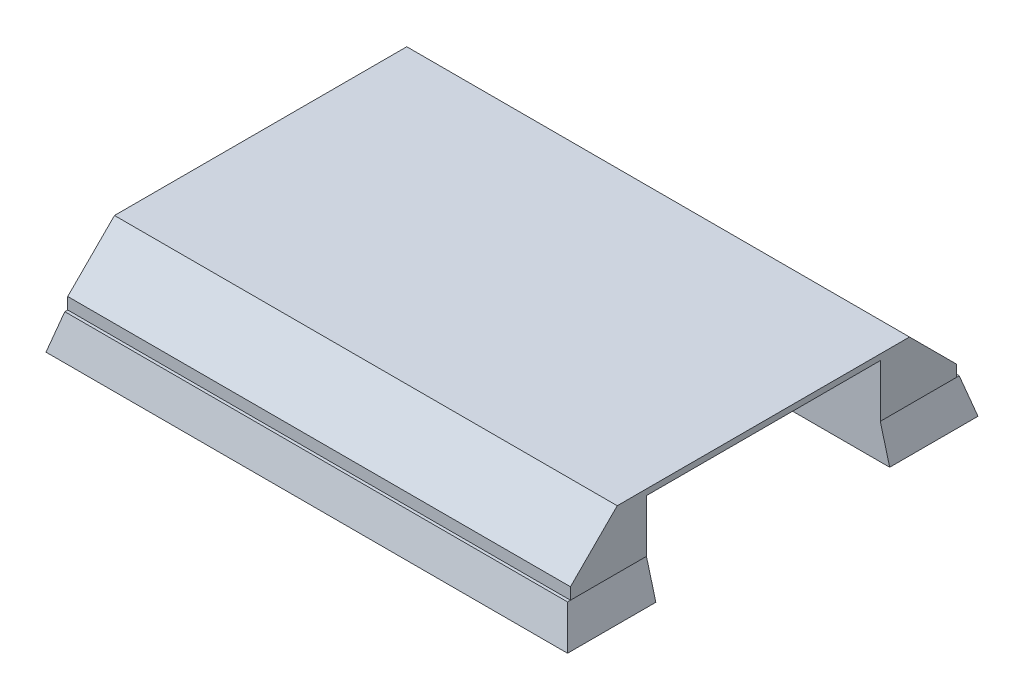
ISO-10303-21;
HEADER;
FILE_DESCRIPTION(('STEP AP214'),'2;1');
FILE_NAME('part.step','',(''),(''),'','','');
FILE_SCHEMA(('AUTOMOTIVE_DESIGN { 1 0 10303 214 1 1 1 1 }'));
ENDSEC;
DATA;
#1=APPLICATION_CONTEXT('core data for automotive mechanical design processes');
#2=APPLICATION_PROTOCOL_DEFINITION('international standard','automotive_design',2000,#1);
#3=PRODUCT_CONTEXT('',#1,'mechanical');
#4=PRODUCT('Part','Part','',(#3));
#5=PRODUCT_RELATED_PRODUCT_CATEGORY('part','',(#4));
#6=PRODUCT_DEFINITION_FORMATION('','',#4);
#7=PRODUCT_DEFINITION_CONTEXT('part definition',#1,'design');
#8=PRODUCT_DEFINITION('design','',#6,#7);
#9=PRODUCT_DEFINITION_SHAPE('','',#8);
#10=(LENGTH_UNIT() NAMED_UNIT(*) SI_UNIT(.MILLI.,.METRE.));
#11=(NAMED_UNIT(*) PLANE_ANGLE_UNIT() SI_UNIT($,.RADIAN.));
#12=(NAMED_UNIT(*) SI_UNIT($,.STERADIAN.) SOLID_ANGLE_UNIT());
#13=UNCERTAINTY_MEASURE_WITH_UNIT(LENGTH_MEASURE(1.E-05),#10,'distance_accuracy_value','');
#14=(GEOMETRIC_REPRESENTATION_CONTEXT(3) GLOBAL_UNCERTAINTY_ASSIGNED_CONTEXT((#13)) GLOBAL_UNIT_ASSIGNED_CONTEXT((#10,
#11,#12)) REPRESENTATION_CONTEXT('',''));
#15=CARTESIAN_POINT('',(0.,0.,0.));
#16=DIRECTION('',(0.,0.,1.));
#17=DIRECTION('',(1.,0.,0.));
#18=AXIS2_PLACEMENT_3D('',#15,#16,#17);
#19=CARTESIAN_POINT('',(0.,-3.,0.));
#20=DIRECTION('',(0.,1.,0.));
#21=DIRECTION('',(0.,0.,1.));
#22=AXIS2_PLACEMENT_3D('',#19,#20,#21);
#23=PLANE('',#22);
#24=DIRECTION('',(0.,0.,-1.));
#25=VECTOR('',#24,1.);
#26=CARTESIAN_POINT('',(22.3038475772934,-3.,0.));
#27=LINE('',#26,#25);
#28=CARTESIAN_POINT('',(22.3038475772934,-3.,-10.));
#29=VERTEX_POINT('',#28);
#30=CARTESIAN_POINT('',(22.3038475772934,-3.,-17.5538475772934));
#31=VERTEX_POINT('',#30);
#32=EDGE_CURVE('E210',#29,#31,#27,.T.);
#33=ORIENTED_EDGE('',*,*,#32,.F.);
#34=DIRECTION('',(-1.,0.,0.));
#35=VECTOR('',#34,1.);
#36=CARTESIAN_POINT('',(0.,-3.,-10.));
#37=LINE('',#36,#35);
#38=CARTESIAN_POINT('',(-22.3038475772934,-3.,-9.99999999999999));
#39=VERTEX_POINT('',#38);
#40=EDGE_CURVE('E191',#29,#39,#37,.T.);
#41=ORIENTED_EDGE('',*,*,#40,.T.);
#42=DIRECTION('',(0.,0.,1.));
#43=VECTOR('',#42,1.);
#44=CARTESIAN_POINT('',(-22.3038475772934,-3.,0.));
#45=LINE('',#44,#43);
#46=CARTESIAN_POINT('',(-22.3038475772934,-3.,-17.5538475772934));
#47=VERTEX_POINT('',#46);
#48=EDGE_CURVE('E230',#47,#39,#45,.T.);
#49=ORIENTED_EDGE('',*,*,#48,.F.);
#50=DIRECTION('',(-1.,0.,0.));
#51=VECTOR('',#50,1.);
#52=CARTESIAN_POINT('',(0.,-3.,-17.5538475772934));
#53=LINE('',#52,#51);
#54=EDGE_CURVE('E221',#31,#47,#53,.T.);
#55=ORIENTED_EDGE('',*,*,#54,.F.);
#56=EDGE_LOOP('',(#33,#41,#49,#55));
#57=FACE_BOUND('',#56,.T.);
#58=ADVANCED_FACE('F41',(#57),#23,.F.);
#59=CARTESIAN_POINT('',(21.5,0.,16.75));
#60=DIRECTION('',(0.965925826289068,0.258819045102521,0.));
#61=DIRECTION('',(-0.258819045102521,0.965925826289068,0.));
#62=AXIS2_PLACEMENT_3D('',#59,#60,#61);
#63=PLANE('',#62);
#64=DIRECTION('',(-0.258819045102521,0.965925826289068,0.));
#65=VECTOR('',#64,1.);
#66=CARTESIAN_POINT('',(21.5,0.,-10.));
#67=LINE('',#66,#65);
#68=CARTESIAN_POINT('',(21.5,0.,-10.));
#69=VERTEX_POINT('',#68);
#70=EDGE_CURVE('E194',#29,#69,#67,.T.);
#71=ORIENTED_EDGE('',*,*,#70,.F.);
#72=ORIENTED_EDGE('',*,*,#32,.T.);
#73=DIRECTION('',(-0.250562807085732,0.935113126531029,0.250562807085732));
#74=VECTOR('',#73,1.);
#75=CARTESIAN_POINT('',(19.3968123701282,7.84920309253205,-14.6468123701282));
#76=LINE('',#75,#74);
#77=CARTESIAN_POINT('',(21.5,0.,-16.75));
#78=VERTEX_POINT('',#77);
#79=EDGE_CURVE('E348',#31,#78,#76,.T.);
#80=ORIENTED_EDGE('',*,*,#79,.T.);
#81=DIRECTION('',(0.,0.,-1.));
#82=VECTOR('',#81,1.);
#83=CARTESIAN_POINT('',(21.5,0.,16.75));
#84=LINE('',#83,#82);
#85=CARTESIAN_POINT('',(21.5,0.,-16.5));
#86=VERTEX_POINT('',#85);
#87=EDGE_CURVE('E336',#86,#78,#84,.T.);
#88=ORIENTED_EDGE('',*,*,#87,.F.);
#89=DIRECTION('',(0.,0.,-1.));
#90=VECTOR('',#89,1.);
#91=CARTESIAN_POINT('',(21.5,0.,16.5));
#92=LINE('',#91,#90);
#93=EDGE_CURVE('E214',#69,#86,#92,.T.);
#94=ORIENTED_EDGE('',*,*,#93,.F.);
#95=EDGE_LOOP('',(#71,#72,#80,#88,#94));
#96=FACE_BOUND('',#95,.T.);
#97=ADVANCED_FACE('F208',(#96),#63,.T.);
#98=DIRECTION('',(1.,0.,0.));
#99=VECTOR('',#98,1.);
#100=CARTESIAN_POINT('',(0.,-3.,10.));
#101=LINE('',#100,#99);
#102=CARTESIAN_POINT('',(-22.3038475772934,-3.,10.));
#103=VERTEX_POINT('',#102);
#104=CARTESIAN_POINT('',(22.3038475772934,-3.,10.));
#105=VERTEX_POINT('',#104);
#106=EDGE_CURVE('E203',#103,#105,#101,.T.);
#107=ORIENTED_EDGE('',*,*,#106,.T.);
#108=CARTESIAN_POINT('',(22.3038475772934,-3.,17.5538475772934));
#109=VERTEX_POINT('',#108);
#110=EDGE_CURVE('E223',#109,#105,#27,.T.);
#111=ORIENTED_EDGE('',*,*,#110,.F.);
#112=DIRECTION('',(1.,0.,0.));
#113=VECTOR('',#112,1.);
#114=CARTESIAN_POINT('',(0.,-3.,17.5538475772934));
#115=LINE('',#114,#113);
#116=CARTESIAN_POINT('',(-22.3038475772934,-3.,17.5538475772934));
#117=VERTEX_POINT('',#116);
#118=EDGE_CURVE('E224',#117,#109,#115,.T.);
#119=ORIENTED_EDGE('',*,*,#118,.F.);
#120=EDGE_CURVE('E345',#103,#117,#45,.T.);
#121=ORIENTED_EDGE('',*,*,#120,.F.);
#122=EDGE_LOOP('',(#107,#111,#119,#121));
#123=FACE_BOUND('',#122,.T.);
#124=ADVANCED_FACE('F370',(#123),#23,.F.);
#125=CARTESIAN_POINT('',(0.,0.,0.));
#126=DIRECTION('',(0.,1.,0.));
#127=DIRECTION('',(0.,0.,1.));
#128=AXIS2_PLACEMENT_3D('',#125,#126,#127);
#129=PLANE('',#128);
#130=DIRECTION('',(1.,0.,0.));
#131=VECTOR('',#130,1.);
#132=CARTESIAN_POINT('',(-21.5,0.,16.5));
#133=LINE('',#132,#131);
#134=CARTESIAN_POINT('',(-21.5,0.,16.5));
#135=VERTEX_POINT('',#134);
#136=CARTESIAN_POINT('',(21.5,0.,16.5));
#137=VERTEX_POINT('',#136);
#138=EDGE_CURVE('E306',#135,#137,#133,.T.);
#139=ORIENTED_EDGE('',*,*,#138,.F.);
#140=DIRECTION('',(0.,0.,1.));
#141=VECTOR('',#140,1.);
#142=CARTESIAN_POINT('',(-21.5,0.,16.75));
#143=LINE('',#142,#141);
#144=CARTESIAN_POINT('',(-21.5,0.,16.75));
#145=VERTEX_POINT('',#144);
#146=EDGE_CURVE('E323',#135,#145,#143,.T.);
#147=ORIENTED_EDGE('',*,*,#146,.T.);
#148=DIRECTION('',(1.,0.,0.));
#149=VECTOR('',#148,1.);
#150=CARTESIAN_POINT('',(21.5,0.,16.75));
#151=LINE('',#150,#149);
#152=CARTESIAN_POINT('',(21.5,0.,16.75));
#153=VERTEX_POINT('',#152);
#154=EDGE_CURVE('E332',#145,#153,#151,.T.);
#155=ORIENTED_EDGE('',*,*,#154,.T.);
#156=EDGE_CURVE('E337',#153,#137,#84,.T.);
#157=ORIENTED_EDGE('',*,*,#156,.T.);
#158=EDGE_LOOP('',(#139,#147,#155,#157));
#159=FACE_BOUND('',#158,.T.);
#160=ADVANCED_FACE('F382',(#159),#129,.T.);
#161=CARTESIAN_POINT('',(-21.5,0.,16.75));
#162=DIRECTION('',(-0.965925826289068,0.258819045102521,0.));
#163=DIRECTION('',(-0.258819045102521,-0.965925826289068,0.));
#164=AXIS2_PLACEMENT_3D('',#161,#162,#163);
#165=PLANE('',#164);
#166=ORIENTED_EDGE('',*,*,#48,.T.);
#167=DIRECTION('',(0.258819045102521,0.965925826289068,0.));
#168=VECTOR('',#167,1.);
#169=CARTESIAN_POINT('',(-20.3570508075689,4.26554445662277,-10.));
#170=LINE('',#169,#168);
#171=CARTESIAN_POINT('',(-21.8660254037844,-1.36602540378436,-10.));
#172=VERTEX_POINT('',#171);
#173=EDGE_CURVE('E197',#39,#172,#170,.T.);
#174=ORIENTED_EDGE('',*,*,#173,.T.);
#175=DIRECTION('',(0.,0.,1.));
#176=VECTOR('',#175,1.);
#177=CARTESIAN_POINT('',(-21.8660254037844,-1.36602540378436,16.75));
#178=LINE('',#177,#176);
#179=CARTESIAN_POINT('',(-21.8660254037844,-1.36602540378436,10.));
#180=VERTEX_POINT('',#179);
#181=EDGE_CURVE('E258',#172,#180,#178,.T.);
#182=ORIENTED_EDGE('',*,*,#181,.T.);
#183=DIRECTION('',(-0.258819045102521,-0.965925826289068,0.));
#184=VECTOR('',#183,1.);
#185=CARTESIAN_POINT('',(-20.3570508075689,4.26554445662277,10.));
#186=LINE('',#185,#184);
#187=EDGE_CURVE('E262',#180,#103,#186,.T.);
#188=ORIENTED_EDGE('',*,*,#187,.T.);
#189=ORIENTED_EDGE('',*,*,#120,.T.);
#190=DIRECTION('',(0.250562807085732,0.935113126531029,-0.250562807085732));
#191=VECTOR('',#190,1.);
#192=CARTESIAN_POINT('',(-21.5,0.,16.75));
#193=LINE('',#192,#191);
#194=EDGE_CURVE('E349',#117,#145,#193,.T.);
#195=ORIENTED_EDGE('',*,*,#194,.T.);
#196=ORIENTED_EDGE('',*,*,#146,.F.);
#197=DIRECTION('',(0.,0.,1.));
#198=VECTOR('',#197,1.);
#199=CARTESIAN_POINT('',(-21.5,0.,16.5));
#200=LINE('',#199,#198);
#201=CARTESIAN_POINT('',(-21.5,0.,-16.5));
#202=VERTEX_POINT('',#201);
#203=EDGE_CURVE('E392',#202,#135,#200,.T.);
#204=ORIENTED_EDGE('',*,*,#203,.F.);
#205=CARTESIAN_POINT('',(-21.5,0.,-16.75));
#206=VERTEX_POINT('',#205);
#207=EDGE_CURVE('E329',#206,#202,#143,.T.);
#208=ORIENTED_EDGE('',*,*,#207,.F.);
#209=DIRECTION('',(0.250562807085732,0.935113126531029,0.250562807085732));
#210=VECTOR('',#209,1.);
#211=CARTESIAN_POINT('',(-18.8003860273287,10.0750965068322,-14.0503860273287));
#212=LINE('',#211,#210);
#213=EDGE_CURVE('E239',#47,#206,#212,.T.);
#214=ORIENTED_EDGE('',*,*,#213,.F.);
#215=EDGE_LOOP('',(#166,#174,#182,#188,#189,#195,#196,#204,#208,#214));
#216=FACE_BOUND('',#215,.T.);
#217=ADVANCED_FACE('F362',(#216),#165,.T.);
#218=CARTESIAN_POINT('',(21.5,0.,-16.75));
#219=DIRECTION('',(0.,0.258819045102521,-0.965925826289068));
#220=DIRECTION('',(0.,0.965925826289068,0.258819045102521));
#221=AXIS2_PLACEMENT_3D('',#218,#219,#220);
#222=PLANE('',#221);
#223=DIRECTION('',(-1.,0.,0.));
#224=VECTOR('',#223,1.);
#225=CARTESIAN_POINT('',(21.5,0.,-16.75));
#226=LINE('',#225,#224);
#227=EDGE_CURVE('E341',#78,#206,#226,.T.);
#228=ORIENTED_EDGE('',*,*,#227,.F.);
#229=ORIENTED_EDGE('',*,*,#79,.F.);
#230=ORIENTED_EDGE('',*,*,#54,.T.);
#231=ORIENTED_EDGE('',*,*,#213,.T.);
#232=EDGE_LOOP('',(#228,#229,#230,#231));
#233=FACE_BOUND('',#232,.T.);
#234=ADVANCED_FACE('F390',(#233),#222,.T.);
#235=DIRECTION('',(0.258819045102521,-0.965925826289068,0.));
#236=VECTOR('',#235,1.);
#237=CARTESIAN_POINT('',(21.5,0.,10.));
#238=LINE('',#237,#236);
#239=CARTESIAN_POINT('',(21.5,0.,10.));
#240=VERTEX_POINT('',#239);
#241=EDGE_CURVE('E217',#240,#105,#238,.T.);
#242=ORIENTED_EDGE('',*,*,#241,.F.);
#243=EDGE_CURVE('E378',#137,#240,#92,.T.);
#244=ORIENTED_EDGE('',*,*,#243,.F.);
#245=ORIENTED_EDGE('',*,*,#156,.F.);
#246=DIRECTION('',(-0.250562807085732,0.935113126531029,-0.250562807085732));
#247=VECTOR('',#246,1.);
#248=CARTESIAN_POINT('',(21.5,0.,16.75));
#249=LINE('',#248,#247);
#250=EDGE_CURVE('E353',#109,#153,#249,.T.);
#251=ORIENTED_EDGE('',*,*,#250,.F.);
#252=ORIENTED_EDGE('',*,*,#110,.T.);
#253=EDGE_LOOP('',(#242,#244,#245,#251,#252));
#254=FACE_BOUND('',#253,.T.);
#255=ADVANCED_FACE('F373',(#254),#63,.T.);
#256=CARTESIAN_POINT('',(21.5,0.,16.75));
#257=DIRECTION('',(0.,0.258819045102521,0.965925826289068));
#258=DIRECTION('',(0.,-0.965925826289068,0.258819045102521));
#259=AXIS2_PLACEMENT_3D('',#256,#257,#258);
#260=PLANE('',#259);
#261=ORIENTED_EDGE('',*,*,#154,.F.);
#262=ORIENTED_EDGE('',*,*,#194,.F.);
#263=ORIENTED_EDGE('',*,*,#118,.T.);
#264=ORIENTED_EDGE('',*,*,#250,.T.);
#265=EDGE_LOOP('',(#261,#262,#263,#264));
#266=FACE_BOUND('',#265,.T.);
#267=ADVANCED_FACE('F368',(#266),#260,.T.);
#268=DIRECTION('',(-1.,0.,0.));
#269=VECTOR('',#268,1.);
#270=CARTESIAN_POINT('',(-21.5,0.,-16.5));
#271=LINE('',#270,#269);
#272=EDGE_CURVE('E317',#86,#202,#271,.T.);
#273=ORIENTED_EDGE('',*,*,#272,.F.);
#274=ORIENTED_EDGE('',*,*,#87,.T.);
#275=ORIENTED_EDGE('',*,*,#227,.T.);
#276=ORIENTED_EDGE('',*,*,#207,.T.);
#277=EDGE_LOOP('',(#273,#274,#275,#276));
#278=FACE_BOUND('',#277,.T.);
#279=ADVANCED_FACE('F387',(#278),#129,.T.);
#280=CARTESIAN_POINT('',(21.5,5.,16.5));
#281=DIRECTION('',(-1.,0.,0.));
#282=DIRECTION('',(0.,0.,1.));
#283=AXIS2_PLACEMENT_3D('',#280,#281,#282);
#284=PLANE('',#283);
#285=DIRECTION('',(0.,-1.,0.));
#286=VECTOR('',#285,1.);
#287=CARTESIAN_POINT('',(21.5,5.,-16.5));
#288=LINE('',#287,#286);
#289=CARTESIAN_POINT('',(21.5,0.99999999999999,-16.5));
#290=VERTEX_POINT('',#289);
#291=EDGE_CURVE('E296',#290,#86,#288,.T.);
#292=ORIENTED_EDGE('',*,*,#291,.F.);
#293=DIRECTION('',(0.,-0.707106781186549,-0.707106781186546));
#294=VECTOR('',#293,1.);
#295=CARTESIAN_POINT('',(21.5,5.,-12.5));
#296=LINE('',#295,#294);
#297=CARTESIAN_POINT('',(21.5,5.,-12.5));
#298=VERTEX_POINT('',#297);
#299=EDGE_CURVE('E51',#290,#298,#296,.F.);
#300=ORIENTED_EDGE('',*,*,#299,.T.);
#301=DIRECTION('',(0.,0.,-1.));
#302=VECTOR('',#301,1.);
#303=CARTESIAN_POINT('',(21.5,5.,16.5));
#304=LINE('',#303,#302);
#305=CARTESIAN_POINT('',(21.5,5.,12.5));
#306=VERTEX_POINT('',#305);
#307=EDGE_CURVE('E295',#306,#298,#304,.T.);
#308=ORIENTED_EDGE('',*,*,#307,.F.);
#309=DIRECTION('',(0.,0.707106781186549,-0.707106781186546));
#310=VECTOR('',#309,1.);
#311=CARTESIAN_POINT('',(21.5,5.,12.5));
#312=LINE('',#311,#310);
#313=CARTESIAN_POINT('',(21.5,0.999999999999976,16.5));
#314=VERTEX_POINT('',#313);
#315=EDGE_CURVE('E58',#306,#314,#312,.F.);
#316=ORIENTED_EDGE('',*,*,#315,.T.);
#317=DIRECTION('',(0.,-1.,0.));
#318=VECTOR('',#317,1.);
#319=CARTESIAN_POINT('',(21.5,5.,16.5));
#320=LINE('',#319,#318);
#321=EDGE_CURVE('E325',#314,#137,#320,.T.);
#322=ORIENTED_EDGE('',*,*,#321,.T.);
#323=ORIENTED_EDGE('',*,*,#243,.T.);
#324=DIRECTION('',(0.,-1.,0.));
#325=VECTOR('',#324,1.);
#326=CARTESIAN_POINT('',(21.5,3.5,10.));
#327=LINE('',#326,#325);
#328=CARTESIAN_POINT('',(21.5,4.5,10.));
#329=VERTEX_POINT('',#328);
#330=EDGE_CURVE('E417',#329,#240,#327,.T.);
#331=ORIENTED_EDGE('',*,*,#330,.F.);
#332=DIRECTION('',(0.,0.,-1.));
#333=VECTOR('',#332,1.);
#334=CARTESIAN_POINT('',(21.5,4.5,16.5));
#335=LINE('',#334,#333);
#336=CARTESIAN_POINT('',(21.5,4.5,-10.));
#337=VERTEX_POINT('',#336);
#338=EDGE_CURVE('E243',#329,#337,#335,.T.);
#339=ORIENTED_EDGE('',*,*,#338,.T.);
#340=DIRECTION('',(0.,-1.,0.));
#341=VECTOR('',#340,1.);
#342=CARTESIAN_POINT('',(21.5,5.,-10.));
#343=LINE('',#342,#341);
#344=EDGE_CURVE('E235',#337,#69,#343,.T.);
#345=ORIENTED_EDGE('',*,*,#344,.T.);
#346=ORIENTED_EDGE('',*,*,#93,.T.);
#347=EDGE_LOOP('',(#292,#300,#308,#316,#322,#323,#331,#339,#345,#346));
#348=FACE_BOUND('',#347,.T.);
#349=ADVANCED_FACE('F294',(#348),#284,.F.);
#350=CARTESIAN_POINT('',(-21.5,5.,-16.5));
#351=DIRECTION('',(0.,0.,1.));
#352=DIRECTION('',(1.,0.,0.));
#353=AXIS2_PLACEMENT_3D('',#350,#351,#352);
#354=PLANE('',#353);
#355=DIRECTION('',(0.,-1.,0.));
#356=VECTOR('',#355,1.);
#357=CARTESIAN_POINT('',(-21.5,5.,-16.5));
#358=LINE('',#357,#356);
#359=CARTESIAN_POINT('',(-21.5,0.99999999999999,-16.5));
#360=VERTEX_POINT('',#359);
#361=EDGE_CURVE('E312',#360,#202,#358,.T.);
#362=ORIENTED_EDGE('',*,*,#361,.F.);
#363=DIRECTION('',(1.,0.,0.));
#364=VECTOR('',#363,1.);
#365=CARTESIAN_POINT('',(-21.5,0.99999999999999,-16.5));
#366=LINE('',#365,#364);
#367=EDGE_CURVE('E66',#360,#290,#366,.T.);
#368=ORIENTED_EDGE('',*,*,#367,.T.);
#369=ORIENTED_EDGE('',*,*,#291,.T.);
#370=ORIENTED_EDGE('',*,*,#272,.T.);
#371=EDGE_LOOP('',(#362,#368,#369,#370));
#372=FACE_BOUND('',#371,.T.);
#373=ADVANCED_FACE('F315',(#372),#354,.F.);
#374=CARTESIAN_POINT('',(-21.5,5.,16.5));
#375=DIRECTION('',(1.,0.,0.));
#376=DIRECTION('',(0.,0.,-1.));
#377=AXIS2_PLACEMENT_3D('',#374,#375,#376);
#378=PLANE('',#377);
#379=DIRECTION('',(0.,0.,1.));
#380=VECTOR('',#379,1.);
#381=CARTESIAN_POINT('',(-21.5,5.,16.5));
#382=LINE('',#381,#380);
#383=CARTESIAN_POINT('',(-21.5,5.,-12.5));
#384=VERTEX_POINT('',#383);
#385=CARTESIAN_POINT('',(-21.5,5.,12.5));
#386=VERTEX_POINT('',#385);
#387=EDGE_CURVE('E305',#384,#386,#382,.T.);
#388=ORIENTED_EDGE('',*,*,#387,.F.);
#389=DIRECTION('',(0.,0.707106781186549,0.707106781186546));
#390=VECTOR('',#389,1.);
#391=CARTESIAN_POINT('',(-21.5,5.,-12.5));
#392=LINE('',#391,#390);
#393=EDGE_CURVE('E285',#384,#360,#392,.F.);
#394=ORIENTED_EDGE('',*,*,#393,.T.);
#395=ORIENTED_EDGE('',*,*,#361,.T.);
#396=ORIENTED_EDGE('',*,*,#203,.T.);
#397=DIRECTION('',(0.,-1.,0.));
#398=VECTOR('',#397,1.);
#399=CARTESIAN_POINT('',(-21.5,5.,16.5));
#400=LINE('',#399,#398);
#401=CARTESIAN_POINT('',(-21.5,0.999999999999976,16.5));
#402=VERTEX_POINT('',#401);
#403=EDGE_CURVE('E319',#402,#135,#400,.T.);
#404=ORIENTED_EDGE('',*,*,#403,.F.);
#405=DIRECTION('',(0.,-0.707106781186549,0.707106781186546));
#406=VECTOR('',#405,1.);
#407=CARTESIAN_POINT('',(-21.5,5.,12.5));
#408=LINE('',#407,#406);
#409=EDGE_CURVE('E282',#402,#386,#408,.F.);
#410=ORIENTED_EDGE('',*,*,#409,.T.);
#411=EDGE_LOOP('',(#388,#394,#395,#396,#404,#410));
#412=FACE_BOUND('',#411,.T.);
#413=ADVANCED_FACE('F310',(#412),#378,.F.);
#414=CARTESIAN_POINT('',(-21.5,5.,16.5));
#415=DIRECTION('',(0.,0.,-1.));
#416=DIRECTION('',(-1.,0.,0.));
#417=AXIS2_PLACEMENT_3D('',#414,#415,#416);
#418=PLANE('',#417);
#419=ORIENTED_EDGE('',*,*,#321,.F.);
#420=DIRECTION('',(-1.,0.,0.));
#421=VECTOR('',#420,1.);
#422=CARTESIAN_POINT('',(-21.5,0.999999999999976,16.5));
#423=LINE('',#422,#421);
#424=EDGE_CURVE('E11',#314,#402,#423,.T.);
#425=ORIENTED_EDGE('',*,*,#424,.T.);
#426=ORIENTED_EDGE('',*,*,#403,.T.);
#427=ORIENTED_EDGE('',*,*,#138,.T.);
#428=EDGE_LOOP('',(#419,#425,#426,#427));
#429=FACE_BOUND('',#428,.T.);
#430=ADVANCED_FACE('F665',(#429),#418,.F.);
#431=CARTESIAN_POINT('',(0.,5.,0.));
#432=DIRECTION('',(0.,-1.,0.));
#433=DIRECTION('',(0.,0.,-1.));
#434=AXIS2_PLACEMENT_3D('',#431,#432,#433);
#435=PLANE('',#434);
#436=ORIENTED_EDGE('',*,*,#307,.T.);
#437=DIRECTION('',(-1.,0.,0.));
#438=VECTOR('',#437,1.);
#439=CARTESIAN_POINT('',(0.,5.,-12.5));
#440=LINE('',#439,#438);
#441=EDGE_CURVE('E278',#298,#384,#440,.T.);
#442=ORIENTED_EDGE('',*,*,#441,.T.);
#443=ORIENTED_EDGE('',*,*,#387,.T.);
#444=DIRECTION('',(1.,0.,0.));
#445=VECTOR('',#444,1.);
#446=CARTESIAN_POINT('',(0.,5.,12.5));
#447=LINE('',#446,#445);
#448=EDGE_CURVE('E274',#386,#306,#447,.T.);
#449=ORIENTED_EDGE('',*,*,#448,.T.);
#450=EDGE_LOOP('',(#436,#442,#443,#449));
#451=FACE_BOUND('',#450,.T.);
#452=ADVANCED_FACE('F300',(#451),#435,.F.);
#453=CARTESIAN_POINT('',(-17.5,0.,0.));
#454=DIRECTION('',(1.,0.,0.));
#455=DIRECTION('',(0.,0.,-1.));
#456=AXIS2_PLACEMENT_3D('',#453,#454,#455);
#457=PLANE('',#456);
#458=DIRECTION('',(0.,-1.,0.));
#459=VECTOR('',#458,1.);
#460=CARTESIAN_POINT('',(-17.5,3.5,10.));
#461=LINE('',#460,#459);
#462=CARTESIAN_POINT('',(-17.5,3.5,10.));
#463=VERTEX_POINT('',#462);
#464=CARTESIAN_POINT('',(-17.5,3.0000000000001,10.));
#465=VERTEX_POINT('',#464);
#466=EDGE_CURVE('E420',#463,#465,#461,.T.);
#467=ORIENTED_EDGE('',*,*,#466,.T.);
#468=DIRECTION('',(0.,0.,-1.));
#469=VECTOR('',#468,1.);
#470=CARTESIAN_POINT('',(-17.5,3.0000000000001,-10.));
#471=LINE('',#470,#469);
#472=CARTESIAN_POINT('',(-17.5,3.0000000000001,-10.));
#473=VERTEX_POINT('',#472);
#474=EDGE_CURVE('E254',#465,#473,#471,.T.);
#475=ORIENTED_EDGE('',*,*,#474,.T.);
#476=DIRECTION('',(0.,1.,0.));
#477=VECTOR('',#476,1.);
#478=CARTESIAN_POINT('',(-17.5,3.5,-10.));
#479=LINE('',#478,#477);
#480=CARTESIAN_POINT('',(-17.5,3.5,-10.));
#481=VERTEX_POINT('',#480);
#482=EDGE_CURVE('E425',#473,#481,#479,.T.);
#483=ORIENTED_EDGE('',*,*,#482,.T.);
#484=DIRECTION('',(0.,0.,1.));
#485=VECTOR('',#484,1.);
#486=CARTESIAN_POINT('',(-17.5,3.5,10.));
#487=LINE('',#486,#485);
#488=EDGE_CURVE('E413',#481,#463,#487,.T.);
#489=ORIENTED_EDGE('',*,*,#488,.T.);
#490=EDGE_LOOP('',(#467,#475,#483,#489));
#491=FACE_BOUND('',#490,.T.);
#492=ADVANCED_FACE('F488',(#491),#457,.T.);
#493=CARTESIAN_POINT('',(-17.5,3.5,10.));
#494=DIRECTION('',(0.,0.,1.));
#495=DIRECTION('',(0.,-1.,0.));
#496=AXIS2_PLACEMENT_3D('',#493,#494,#495);
#497=PLANE('',#496);
#498=ORIENTED_EDGE('',*,*,#466,.F.);
#499=DIRECTION('',(1.,0.,0.));
#500=VECTOR('',#499,1.);
#501=CARTESIAN_POINT('',(-17.5,3.5,10.));
#502=LINE('',#501,#500);
#503=CARTESIAN_POINT('',(20.5,3.5,10.));
#504=VERTEX_POINT('',#503);
#505=EDGE_CURVE('E204',#463,#504,#502,.T.);
#506=ORIENTED_EDGE('',*,*,#505,.T.);
#507=DIRECTION('',(-0.707106781186548,-0.707106781186547,0.));
#508=VECTOR('',#507,1.);
#509=CARTESIAN_POINT('',(1.49999999999999,-15.5,10.));
#510=LINE('',#509,#508);
#511=EDGE_CURVE('E247',#504,#329,#510,.F.);
#512=ORIENTED_EDGE('',*,*,#511,.T.);
#513=ORIENTED_EDGE('',*,*,#330,.T.);
#514=ORIENTED_EDGE('',*,*,#241,.T.);
#515=ORIENTED_EDGE('',*,*,#106,.F.);
#516=ORIENTED_EDGE('',*,*,#187,.F.);
#517=DIRECTION('',(0.707106781186544,0.707106781186551,0.));
#518=VECTOR('',#517,1.);
#519=CARTESIAN_POINT('',(-17.25,3.25000000000006,10.));
#520=LINE('',#519,#518);
#521=EDGE_CURVE('E271',#180,#465,#520,.T.);
#522=ORIENTED_EDGE('',*,*,#521,.T.);
#523=EDGE_LOOP('',(#498,#506,#512,#513,#514,#515,#516,#522));
#524=FACE_BOUND('',#523,.T.);
#525=ADVANCED_FACE('F476',(#524),#497,.F.);
#526=CARTESIAN_POINT('',(-17.5,3.5,-10.));
#527=DIRECTION('',(0.,0.,-1.));
#528=DIRECTION('',(-1.,0.,0.));
#529=AXIS2_PLACEMENT_3D('',#526,#527,#528);
#530=PLANE('',#529);
#531=ORIENTED_EDGE('',*,*,#40,.F.);
#532=ORIENTED_EDGE('',*,*,#70,.T.);
#533=ORIENTED_EDGE('',*,*,#344,.F.);
#534=DIRECTION('',(0.707106781186548,0.707106781186547,0.));
#535=VECTOR('',#534,1.);
#536=CARTESIAN_POINT('',(1.49999999999999,-15.5,-10.));
#537=LINE('',#536,#535);
#538=CARTESIAN_POINT('',(20.5,3.5,-10.));
#539=VERTEX_POINT('',#538);
#540=EDGE_CURVE('E251',#337,#539,#537,.F.);
#541=ORIENTED_EDGE('',*,*,#540,.T.);
#542=DIRECTION('',(1.,0.,0.));
#543=VECTOR('',#542,1.);
#544=CARTESIAN_POINT('',(-17.5,3.5,-10.));
#545=LINE('',#544,#543);
#546=EDGE_CURVE('E409',#481,#539,#545,.T.);
#547=ORIENTED_EDGE('',*,*,#546,.F.);
#548=ORIENTED_EDGE('',*,*,#482,.F.);
#549=DIRECTION('',(-0.707106781186544,-0.707106781186551,0.));
#550=VECTOR('',#549,1.);
#551=CARTESIAN_POINT('',(-17.25,3.25000000000006,-10.));
#552=LINE('',#551,#550);
#553=EDGE_CURVE('E268',#473,#172,#552,.T.);
#554=ORIENTED_EDGE('',*,*,#553,.T.);
#555=ORIENTED_EDGE('',*,*,#173,.F.);
#556=EDGE_LOOP('',(#531,#532,#533,#541,#547,#548,#554,#555));
#557=FACE_BOUND('',#556,.T.);
#558=ADVANCED_FACE('F193',(#557),#530,.F.);
#559=CARTESIAN_POINT('',(-17.5,3.5,10.));
#560=DIRECTION('',(0.,1.,0.));
#561=DIRECTION('',(0.,0.,1.));
#562=AXIS2_PLACEMENT_3D('',#559,#560,#561);
#563=PLANE('',#562);
#564=DIRECTION('',(-1.,0.,0.));
#565=VECTOR('',#564,1.);
#566=CARTESIAN_POINT('',(18.5,3.5,9.));
#567=LINE('',#566,#565);
#568=CARTESIAN_POINT('',(18.5,3.5,9.));
#569=VERTEX_POINT('',#568);
#570=CARTESIAN_POINT('',(10.5,3.5,9.));
#571=VERTEX_POINT('',#570);
#572=EDGE_CURVE('E453',#569,#571,#567,.T.);
#573=ORIENTED_EDGE('',*,*,#572,.F.);
#574=DIRECTION('',(0.,0.,1.));
#575=VECTOR('',#574,1.);
#576=CARTESIAN_POINT('',(18.5,3.5,9.));
#577=LINE('',#576,#575);
#578=CARTESIAN_POINT('',(18.5,3.5,-9.));
#579=VERTEX_POINT('',#578);
#580=EDGE_CURVE('E216',#579,#569,#577,.T.);
#581=ORIENTED_EDGE('',*,*,#580,.F.);
#582=DIRECTION('',(1.,0.,0.));
#583=VECTOR('',#582,1.);
#584=CARTESIAN_POINT('',(18.5,3.5,-9.));
#585=LINE('',#584,#583);
#586=CARTESIAN_POINT('',(10.5,3.5,-9.));
#587=VERTEX_POINT('',#586);
#588=EDGE_CURVE('E444',#587,#579,#585,.T.);
#589=ORIENTED_EDGE('',*,*,#588,.F.);
#590=DIRECTION('',(0.,0.,-1.));
#591=VECTOR('',#590,1.);
#592=CARTESIAN_POINT('',(10.5,3.5,9.));
#593=LINE('',#592,#591);
#594=EDGE_CURVE('E449',#571,#587,#593,.T.);
#595=ORIENTED_EDGE('',*,*,#594,.F.);
#596=EDGE_LOOP('',(#573,#581,#589,#595));
#597=FACE_BOUND('',#596,.T.);
#598=ORIENTED_EDGE('',*,*,#546,.T.);
#599=DIRECTION('',(0.,0.,1.));
#600=VECTOR('',#599,1.);
#601=CARTESIAN_POINT('',(20.5,3.5,10.));
#602=LINE('',#601,#600);
#603=EDGE_CURVE('E238',#539,#504,#602,.T.);
#604=ORIENTED_EDGE('',*,*,#603,.T.);
#605=ORIENTED_EDGE('',*,*,#505,.F.);
#606=ORIENTED_EDGE('',*,*,#488,.F.);
#607=EDGE_LOOP('',(#598,#604,#605,#606));
#608=FACE_BOUND('',#607,.T.);
#609=ADVANCED_FACE('F486',(#597,#608),#563,.F.);
#610=CARTESIAN_POINT('',(18.5,4.5,9.));
#611=DIRECTION('',(1.,0.,0.));
#612=DIRECTION('',(0.,0.,-1.));
#613=AXIS2_PLACEMENT_3D('',#610,#611,#612);
#614=PLANE('',#613);
#615=ORIENTED_EDGE('',*,*,#580,.T.);
#616=DIRECTION('',(0.,-1.,0.));
#617=VECTOR('',#616,1.);
#618=CARTESIAN_POINT('',(18.5,4.5,9.));
#619=LINE('',#618,#617);
#620=CARTESIAN_POINT('',(18.5,4.5,9.));
#621=VERTEX_POINT('',#620);
#622=EDGE_CURVE('E431',#621,#569,#619,.T.);
#623=ORIENTED_EDGE('',*,*,#622,.F.);
#624=DIRECTION('',(0.,0.,1.));
#625=VECTOR('',#624,1.);
#626=CARTESIAN_POINT('',(18.5,4.5,9.));
#627=LINE('',#626,#625);
#628=CARTESIAN_POINT('',(18.5,4.5,-9.));
#629=VERTEX_POINT('',#628);
#630=EDGE_CURVE('E448',#629,#621,#627,.T.);
#631=ORIENTED_EDGE('',*,*,#630,.F.);
#632=DIRECTION('',(0.,-1.,0.));
#633=VECTOR('',#632,1.);
#634=CARTESIAN_POINT('',(18.5,4.5,-9.));
#635=LINE('',#634,#633);
#636=EDGE_CURVE('E421',#629,#579,#635,.T.);
#637=ORIENTED_EDGE('',*,*,#636,.T.);
#638=EDGE_LOOP('',(#615,#623,#631,#637));
#639=FACE_BOUND('',#638,.T.);
#640=ADVANCED_FACE('F589',(#639),#614,.F.);
#641=CARTESIAN_POINT('',(18.5,4.5,-9.));
#642=DIRECTION('',(0.,0.,-1.));
#643=DIRECTION('',(-1.,0.,0.));
#644=AXIS2_PLACEMENT_3D('',#641,#642,#643);
#645=PLANE('',#644);
#646=ORIENTED_EDGE('',*,*,#588,.T.);
#647=ORIENTED_EDGE('',*,*,#636,.F.);
#648=DIRECTION('',(1.,0.,0.));
#649=VECTOR('',#648,1.);
#650=CARTESIAN_POINT('',(18.5,4.5,-9.));
#651=LINE('',#650,#649);
#652=CARTESIAN_POINT('',(10.5,4.5,-9.));
#653=VERTEX_POINT('',#652);
#654=EDGE_CURVE('E436',#653,#629,#651,.T.);
#655=ORIENTED_EDGE('',*,*,#654,.F.);
#656=DIRECTION('',(0.,-1.,0.));
#657=VECTOR('',#656,1.);
#658=CARTESIAN_POINT('',(10.5,4.5,-9.));
#659=LINE('',#658,#657);
#660=EDGE_CURVE('E439',#653,#587,#659,.T.);
#661=ORIENTED_EDGE('',*,*,#660,.T.);
#662=EDGE_LOOP('',(#646,#647,#655,#661));
#663=FACE_BOUND('',#662,.T.);
#664=ADVANCED_FACE('F599',(#663),#645,.F.);
#665=CARTESIAN_POINT('',(10.5,4.5,9.));
#666=DIRECTION('',(-1.,0.,0.));
#667=DIRECTION('',(0.,0.,1.));
#668=AXIS2_PLACEMENT_3D('',#665,#666,#667);
#669=PLANE('',#668);
#670=ORIENTED_EDGE('',*,*,#594,.T.);
#671=ORIENTED_EDGE('',*,*,#660,.F.);
#672=DIRECTION('',(0.,0.,-1.));
#673=VECTOR('',#672,1.);
#674=CARTESIAN_POINT('',(10.5,4.5,9.));
#675=LINE('',#674,#673);
#676=CARTESIAN_POINT('',(10.5,4.5,9.));
#677=VERTEX_POINT('',#676);
#678=EDGE_CURVE('E462',#677,#653,#675,.T.);
#679=ORIENTED_EDGE('',*,*,#678,.F.);
#680=DIRECTION('',(0.,-1.,0.));
#681=VECTOR('',#680,1.);
#682=CARTESIAN_POINT('',(10.5,4.5,9.));
#683=LINE('',#682,#681);
#684=EDGE_CURVE('E435',#677,#571,#683,.T.);
#685=ORIENTED_EDGE('',*,*,#684,.T.);
#686=EDGE_LOOP('',(#670,#671,#679,#685));
#687=FACE_BOUND('',#686,.T.);
#688=ADVANCED_FACE('F607',(#687),#669,.F.);
#689=CARTESIAN_POINT('',(18.5,4.5,9.));
#690=DIRECTION('',(0.,0.,1.));
#691=DIRECTION('',(1.,0.,0.));
#692=AXIS2_PLACEMENT_3D('',#689,#690,#691);
#693=PLANE('',#692);
#694=ORIENTED_EDGE('',*,*,#572,.T.);
#695=ORIENTED_EDGE('',*,*,#684,.F.);
#696=DIRECTION('',(-1.,0.,0.));
#697=VECTOR('',#696,1.);
#698=CARTESIAN_POINT('',(18.5,4.5,9.));
#699=LINE('',#698,#697);
#700=EDGE_CURVE('E466',#621,#677,#699,.T.);
#701=ORIENTED_EDGE('',*,*,#700,.F.);
#702=ORIENTED_EDGE('',*,*,#622,.T.);
#703=EDGE_LOOP('',(#694,#695,#701,#702));
#704=FACE_BOUND('',#703,.T.);
#705=ADVANCED_FACE('F615',(#704),#693,.F.);
#706=CARTESIAN_POINT('',(0.,4.5,0.));
#707=DIRECTION('',(0.,1.,0.));
#708=DIRECTION('',(0.,0.,1.));
#709=AXIS2_PLACEMENT_3D('',#706,#707,#708);
#710=PLANE('',#709);
#711=ORIENTED_EDGE('',*,*,#630,.T.);
#712=ORIENTED_EDGE('',*,*,#700,.T.);
#713=ORIENTED_EDGE('',*,*,#678,.T.);
#714=ORIENTED_EDGE('',*,*,#654,.T.);
#715=EDGE_LOOP('',(#711,#712,#713,#714));
#716=FACE_BOUND('',#715,.T.);
#717=ADVANCED_FACE('F500',(#716),#710,.F.);
#718=CARTESIAN_POINT('',(20.5,3.5,10.));
#719=DIRECTION('',(-0.707106781186547,0.707106781186548,0.));
#720=DIRECTION('',(0.,0.,1.));
#721=AXIS2_PLACEMENT_3D('',#718,#719,#720);
#722=PLANE('',#721);
#723=ORIENTED_EDGE('',*,*,#540,.F.);
#724=ORIENTED_EDGE('',*,*,#338,.F.);
#725=ORIENTED_EDGE('',*,*,#511,.F.);
#726=ORIENTED_EDGE('',*,*,#603,.F.);
#727=EDGE_LOOP('',(#723,#724,#725,#726));
#728=FACE_BOUND('',#727,.T.);
#729=ADVANCED_FACE('F481',(#728),#722,.F.);
#730=CARTESIAN_POINT('',(-17.5,3.0000000000001,0.));
#731=DIRECTION('',(0.707106781186551,-0.707106781186544,0.));
#732=DIRECTION('',(0.,0.,1.));
#733=AXIS2_PLACEMENT_3D('',#730,#731,#732);
#734=PLANE('',#733);
#735=ORIENTED_EDGE('',*,*,#521,.F.);
#736=ORIENTED_EDGE('',*,*,#181,.F.);
#737=ORIENTED_EDGE('',*,*,#553,.F.);
#738=ORIENTED_EDGE('',*,*,#474,.F.);
#739=EDGE_LOOP('',(#735,#736,#737,#738));
#740=FACE_BOUND('',#739,.T.);
#741=ADVANCED_FACE('F493',(#740),#734,.T.);
#742=CARTESIAN_POINT('',(0.,5.,-12.5));
#743=DIRECTION('',(0.,-0.707106781186546,0.707106781186549));
#744=DIRECTION('',(-1.,0.,0.));
#745=AXIS2_PLACEMENT_3D('',#742,#743,#744);
#746=PLANE('',#745);
#747=ORIENTED_EDGE('',*,*,#299,.F.);
#748=ORIENTED_EDGE('',*,*,#367,.F.);
#749=ORIENTED_EDGE('',*,*,#393,.F.);
#750=ORIENTED_EDGE('',*,*,#441,.F.);
#751=EDGE_LOOP('',(#747,#748,#749,#750));
#752=FACE_BOUND('',#751,.T.);
#753=ADVANCED_FACE('F308',(#752),#746,.F.);
#754=CARTESIAN_POINT('',(0.,5.,12.5));
#755=DIRECTION('',(0.,-0.707106781186546,-0.707106781186549));
#756=DIRECTION('',(1.,0.,0.));
#757=AXIS2_PLACEMENT_3D('',#754,#755,#756);
#758=PLANE('',#757);
#759=ORIENTED_EDGE('',*,*,#409,.F.);
#760=ORIENTED_EDGE('',*,*,#424,.F.);
#761=ORIENTED_EDGE('',*,*,#315,.F.);
#762=ORIENTED_EDGE('',*,*,#448,.F.);
#763=EDGE_LOOP('',(#759,#760,#761,#762));
#764=FACE_BOUND('',#763,.T.);
#765=ADVANCED_FACE('F44',(#764),#758,.F.);
#766=CLOSED_SHELL('',(#58,#97,#124,#160,#217,#234,#255,#267,#279,#349,#373,#413,#430,#452,#492,
#525,#558,#609,#640,#664,#688,#705,#717,#729,#741,#753,#765));
#767=MANIFOLD_SOLID_BREP('B2',#766);
#768=ADVANCED_BREP_SHAPE_REPRESENTATION('',(#18,#767),#14);
#769=SHAPE_DEFINITION_REPRESENTATION(#9,#768);
ENDSEC;
END-ISO-10303-21;
